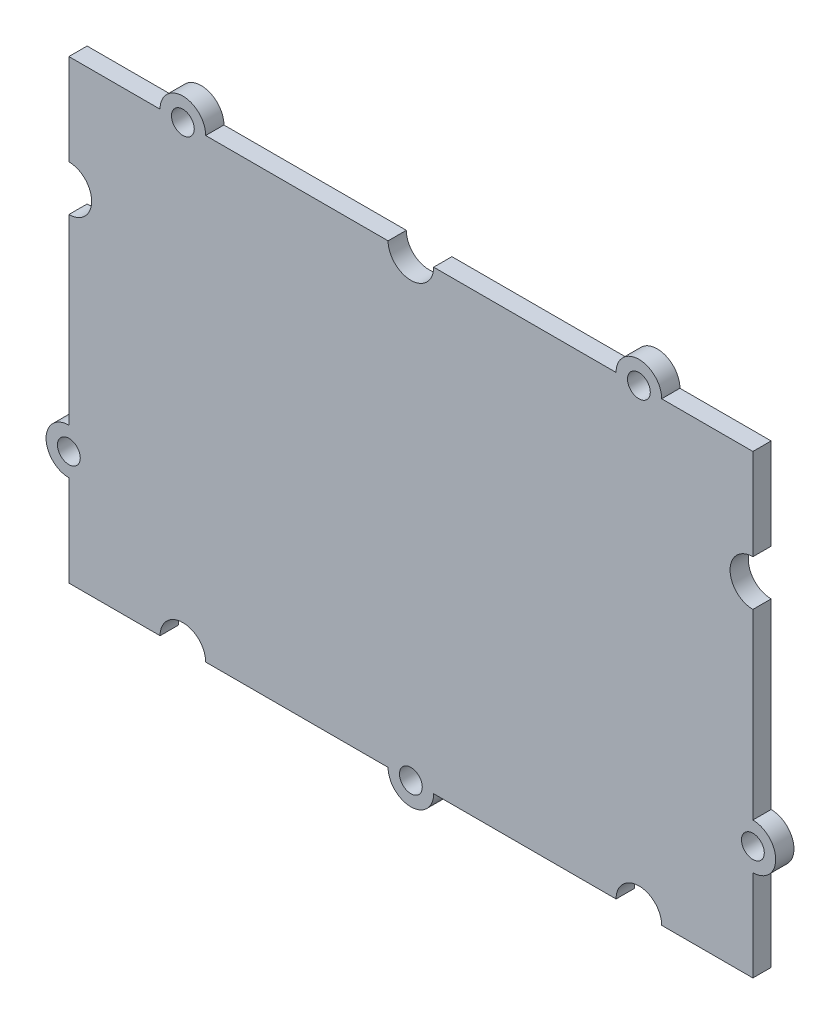
ISO-10303-21;
HEADER;
FILE_DESCRIPTION(('STEP AP214'),'2;1');
FILE_NAME('part.step','',(''),(''),'','','');
FILE_SCHEMA(('AUTOMOTIVE_DESIGN { 1 0 10303 214 1 1 1 1 }'));
ENDSEC;
DATA;
#1=APPLICATION_CONTEXT('core data for automotive mechanical design processes');
#2=APPLICATION_PROTOCOL_DEFINITION('international standard','automotive_design',2000,#1);
#3=PRODUCT_CONTEXT('',#1,'mechanical');
#4=PRODUCT('Part','Part','',(#3));
#5=PRODUCT_RELATED_PRODUCT_CATEGORY('part','',(#4));
#6=PRODUCT_DEFINITION_FORMATION('','',#4);
#7=PRODUCT_DEFINITION_CONTEXT('part definition',#1,'design');
#8=PRODUCT_DEFINITION('design','',#6,#7);
#9=PRODUCT_DEFINITION_SHAPE('','',#8);
#10=(LENGTH_UNIT() NAMED_UNIT(*) SI_UNIT(.MILLI.,.METRE.));
#11=(NAMED_UNIT(*) PLANE_ANGLE_UNIT() SI_UNIT($,.RADIAN.));
#12=(NAMED_UNIT(*) SI_UNIT($,.STERADIAN.) SOLID_ANGLE_UNIT());
#13=UNCERTAINTY_MEASURE_WITH_UNIT(LENGTH_MEASURE(1.E-05),#10,'distance_accuracy_value','');
#14=(GEOMETRIC_REPRESENTATION_CONTEXT(3) GLOBAL_UNCERTAINTY_ASSIGNED_CONTEXT((#13)) GLOBAL_UNIT_ASSIGNED_CONTEXT((#10,
#11,#12)) REPRESENTATION_CONTEXT('',''));
#15=CARTESIAN_POINT('',(0.,0.,0.));
#16=DIRECTION('',(0.,0.,1.));
#17=DIRECTION('',(1.,0.,0.));
#18=AXIS2_PLACEMENT_3D('',#15,#16,#17);
#19=CARTESIAN_POINT('',(-30.,10.,1.6));
#20=DIRECTION('',(0.,0.,-1.));
#21=DIRECTION('',(-1.,0.,0.));
#22=AXIS2_PLACEMENT_3D('',#19,#20,#21);
#23=PLANE('',#22);
#24=DIRECTION('',(0.,-1.,0.));
#25=VECTOR('',#24,1.);
#26=CARTESIAN_POINT('',(-30.,20.,1.6));
#27=LINE('',#26,#25);
#28=CARTESIAN_POINT('',(-30.,20.,1.6));
#29=VERTEX_POINT('',#28);
#30=CARTESIAN_POINT('',(-30.,12.,1.6));
#31=VERTEX_POINT('',#30);
#32=EDGE_CURVE('E274',#29,#31,#27,.T.);
#33=ORIENTED_EDGE('',*,*,#32,.T.);
#34=CARTESIAN_POINT('',(-30.,10.,1.6));
#35=DIRECTION('',(0.,0.,-1.));
#36=DIRECTION('',(-1.,0.,0.));
#37=AXIS2_PLACEMENT_3D('',#34,#35,#36);
#38=CIRCLE('',#37,2.);
#39=CARTESIAN_POINT('',(-30.,8.,1.6));
#40=VERTEX_POINT('',#39);
#41=EDGE_CURVE('E142',#31,#40,#38,.T.);
#42=ORIENTED_EDGE('',*,*,#41,.T.);
#43=DIRECTION('',(0.,-1.,0.));
#44=VECTOR('',#43,1.);
#45=CARTESIAN_POINT('',(-30.,8.,1.6));
#46=LINE('',#45,#44);
#47=CARTESIAN_POINT('',(-30.,-8.,1.6));
#48=VERTEX_POINT('',#47);
#49=EDGE_CURVE('E337',#40,#48,#46,.T.);
#50=ORIENTED_EDGE('',*,*,#49,.T.);
#51=CARTESIAN_POINT('',(-30.,-10.,1.6));
#52=DIRECTION('',(0.,0.,1.));
#53=DIRECTION('',(-1.,0.,0.));
#54=AXIS2_PLACEMENT_3D('',#51,#52,#53);
#55=CIRCLE('',#54,2.);
#56=CARTESIAN_POINT('',(-30.,-12.,1.6));
#57=VERTEX_POINT('',#56);
#58=EDGE_CURVE('E356',#48,#57,#55,.T.);
#59=ORIENTED_EDGE('',*,*,#58,.T.);
#60=DIRECTION('',(0.,-1.,0.));
#61=VECTOR('',#60,1.);
#62=CARTESIAN_POINT('',(-30.,-12.,1.6));
#63=LINE('',#62,#61);
#64=CARTESIAN_POINT('',(-30.,-20.,1.6));
#65=VERTEX_POINT('',#64);
#66=EDGE_CURVE('E353',#57,#65,#63,.T.);
#67=ORIENTED_EDGE('',*,*,#66,.T.);
#68=DIRECTION('',(1.,0.,0.));
#69=VECTOR('',#68,1.);
#70=CARTESIAN_POINT('',(-30.,-20.,1.6));
#71=LINE('',#70,#69);
#72=CARTESIAN_POINT('',(-22.,-20.,1.6));
#73=VERTEX_POINT('',#72);
#74=EDGE_CURVE('E355',#65,#73,#71,.T.);
#75=ORIENTED_EDGE('',*,*,#74,.T.);
#76=CARTESIAN_POINT('',(-20.,-20.,1.6));
#77=DIRECTION('',(0.,0.,-1.));
#78=DIRECTION('',(-1.,0.,0.));
#79=AXIS2_PLACEMENT_3D('',#76,#77,#78);
#80=CIRCLE('',#79,2.);
#81=CARTESIAN_POINT('',(-18.,-20.,1.6));
#82=VERTEX_POINT('',#81);
#83=EDGE_CURVE('E358',#73,#82,#80,.T.);
#84=ORIENTED_EDGE('',*,*,#83,.T.);
#85=DIRECTION('',(1.,0.,0.));
#86=VECTOR('',#85,1.);
#87=CARTESIAN_POINT('',(-18.,-20.,1.6));
#88=LINE('',#87,#86);
#89=CARTESIAN_POINT('',(-2.00000000000001,-20.,1.6));
#90=VERTEX_POINT('',#89);
#91=EDGE_CURVE('E364',#82,#90,#88,.T.);
#92=ORIENTED_EDGE('',*,*,#91,.T.);
#93=CARTESIAN_POINT('',(0.,-20.,1.6));
#94=DIRECTION('',(0.,0.,1.));
#95=DIRECTION('',(-1.,0.,0.));
#96=AXIS2_PLACEMENT_3D('',#93,#94,#95);
#97=CIRCLE('',#96,2.);
#98=CARTESIAN_POINT('',(1.99999999999999,-20.,1.6));
#99=VERTEX_POINT('',#98);
#100=EDGE_CURVE('E366',#90,#99,#97,.T.);
#101=ORIENTED_EDGE('',*,*,#100,.T.);
#102=DIRECTION('',(1.,0.,0.));
#103=VECTOR('',#102,1.);
#104=CARTESIAN_POINT('',(1.99999999999999,-20.,1.6));
#105=LINE('',#104,#103);
#106=CARTESIAN_POINT('',(18.,-20.,1.6));
#107=VERTEX_POINT('',#106);
#108=EDGE_CURVE('E368',#99,#107,#105,.T.);
#109=ORIENTED_EDGE('',*,*,#108,.T.);
#110=CARTESIAN_POINT('',(20.,-20.,1.6));
#111=DIRECTION('',(0.,0.,-1.));
#112=DIRECTION('',(-1.,0.,0.));
#113=AXIS2_PLACEMENT_3D('',#110,#111,#112);
#114=CIRCLE('',#113,2.);
#115=CARTESIAN_POINT('',(22.,-20.,1.6));
#116=VERTEX_POINT('',#115);
#117=EDGE_CURVE('E370',#107,#116,#114,.T.);
#118=ORIENTED_EDGE('',*,*,#117,.T.);
#119=DIRECTION('',(1.,0.,0.));
#120=VECTOR('',#119,1.);
#121=CARTESIAN_POINT('',(22.,-20.,1.6));
#122=LINE('',#121,#120);
#123=CARTESIAN_POINT('',(30.,-20.,1.6));
#124=VERTEX_POINT('',#123);
#125=EDGE_CURVE('E372',#116,#124,#122,.T.);
#126=ORIENTED_EDGE('',*,*,#125,.T.);
#127=DIRECTION('',(0.,1.,0.));
#128=VECTOR('',#127,1.);
#129=CARTESIAN_POINT('',(30.,-12.,1.6));
#130=LINE('',#129,#128);
#131=CARTESIAN_POINT('',(30.,-12.,1.6));
#132=VERTEX_POINT('',#131);
#133=EDGE_CURVE('E374',#124,#132,#130,.T.);
#134=ORIENTED_EDGE('',*,*,#133,.T.);
#135=CARTESIAN_POINT('',(30.,-10.,1.6));
#136=DIRECTION('',(0.,0.,1.));
#137=DIRECTION('',(1.,0.,0.));
#138=AXIS2_PLACEMENT_3D('',#135,#136,#137);
#139=CIRCLE('',#138,2.);
#140=CARTESIAN_POINT('',(30.,-8.,1.6));
#141=VERTEX_POINT('',#140);
#142=EDGE_CURVE('E376',#132,#141,#139,.T.);
#143=ORIENTED_EDGE('',*,*,#142,.T.);
#144=DIRECTION('',(0.,1.,0.));
#145=VECTOR('',#144,1.);
#146=CARTESIAN_POINT('',(30.,8.,1.6));
#147=LINE('',#146,#145);
#148=CARTESIAN_POINT('',(30.,8.,1.6));
#149=VERTEX_POINT('',#148);
#150=EDGE_CURVE('E378',#141,#149,#147,.T.);
#151=ORIENTED_EDGE('',*,*,#150,.T.);
#152=CARTESIAN_POINT('',(30.,10.,1.6));
#153=DIRECTION('',(0.,0.,-1.));
#154=DIRECTION('',(1.,0.,0.));
#155=AXIS2_PLACEMENT_3D('',#152,#153,#154);
#156=CIRCLE('',#155,2.);
#157=CARTESIAN_POINT('',(30.,12.,1.6));
#158=VERTEX_POINT('',#157);
#159=EDGE_CURVE('E380',#149,#158,#156,.T.);
#160=ORIENTED_EDGE('',*,*,#159,.T.);
#161=DIRECTION('',(0.,1.,0.));
#162=VECTOR('',#161,1.);
#163=CARTESIAN_POINT('',(30.,20.,1.6));
#164=LINE('',#163,#162);
#165=CARTESIAN_POINT('',(30.,20.,1.6));
#166=VERTEX_POINT('',#165);
#167=EDGE_CURVE('E382',#158,#166,#164,.T.);
#168=ORIENTED_EDGE('',*,*,#167,.T.);
#169=DIRECTION('',(-1.,0.,0.));
#170=VECTOR('',#169,1.);
#171=CARTESIAN_POINT('',(22.,20.,1.6));
#172=LINE('',#171,#170);
#173=CARTESIAN_POINT('',(22.,20.,1.6));
#174=VERTEX_POINT('',#173);
#175=EDGE_CURVE('E384',#166,#174,#172,.T.);
#176=ORIENTED_EDGE('',*,*,#175,.T.);
#177=CARTESIAN_POINT('',(20.,20.,1.6));
#178=DIRECTION('',(0.,0.,1.));
#179=DIRECTION('',(1.,0.,0.));
#180=AXIS2_PLACEMENT_3D('',#177,#178,#179);
#181=CIRCLE('',#180,2.);
#182=CARTESIAN_POINT('',(18.,20.,1.6));
#183=VERTEX_POINT('',#182);
#184=EDGE_CURVE('E386',#174,#183,#181,.T.);
#185=ORIENTED_EDGE('',*,*,#184,.T.);
#186=DIRECTION('',(-1.,0.,0.));
#187=VECTOR('',#186,1.);
#188=CARTESIAN_POINT('',(1.99999999999999,20.,1.6));
#189=LINE('',#188,#187);
#190=CARTESIAN_POINT('',(1.99999999999999,20.,1.6));
#191=VERTEX_POINT('',#190);
#192=EDGE_CURVE('E388',#183,#191,#189,.T.);
#193=ORIENTED_EDGE('',*,*,#192,.T.);
#194=CARTESIAN_POINT('',(0.,20.,1.6));
#195=DIRECTION('',(0.,0.,-1.));
#196=DIRECTION('',(1.,0.,0.));
#197=AXIS2_PLACEMENT_3D('',#194,#195,#196);
#198=CIRCLE('',#197,2.);
#199=CARTESIAN_POINT('',(-2.00000000000001,20.,1.6));
#200=VERTEX_POINT('',#199);
#201=EDGE_CURVE('E209',#191,#200,#198,.T.);
#202=ORIENTED_EDGE('',*,*,#201,.T.);
#203=DIRECTION('',(-1.,0.,0.));
#204=VECTOR('',#203,1.);
#205=CARTESIAN_POINT('',(-18.,20.,1.6));
#206=LINE('',#205,#204);
#207=CARTESIAN_POINT('',(-18.,20.,1.6));
#208=VERTEX_POINT('',#207);
#209=EDGE_CURVE('E203',#200,#208,#206,.T.);
#210=ORIENTED_EDGE('',*,*,#209,.T.);
#211=CARTESIAN_POINT('',(-20.,20.,1.6));
#212=DIRECTION('',(0.,0.,1.));
#213=DIRECTION('',(1.,0.,0.));
#214=AXIS2_PLACEMENT_3D('',#211,#212,#213);
#215=CIRCLE('',#214,2.);
#216=CARTESIAN_POINT('',(-22.,20.,1.6));
#217=VERTEX_POINT('',#216);
#218=EDGE_CURVE('E207',#208,#217,#215,.T.);
#219=ORIENTED_EDGE('',*,*,#218,.T.);
#220=DIRECTION('',(-1.,0.,0.));
#221=VECTOR('',#220,1.);
#222=CARTESIAN_POINT('',(-30.,20.,1.6));
#223=LINE('',#222,#221);
#224=EDGE_CURVE('E51',#217,#29,#223,.T.);
#225=ORIENTED_EDGE('',*,*,#224,.T.);
#226=EDGE_LOOP('',(#33,#42,#50,#59,#67,#75,#84,#92,#101,#109,#118,#126,#134,#143,#151,#160,#168,
#176,#185,#193,#202,#210,#219,#225));
#227=FACE_BOUND('',#226,.T.);
#228=CARTESIAN_POINT('',(-20.,20.,1.6));
#229=DIRECTION('',(0.,0.,1.));
#230=DIRECTION('',(1.,0.,0.));
#231=AXIS2_PLACEMENT_3D('',#228,#229,#230);
#232=CIRCLE('',#231,1.);
#233=CARTESIAN_POINT('',(-19.,20.,1.6));
#234=VERTEX_POINT('',#233);
#235=EDGE_CURVE('E231',#234,#234,#232,.T.);
#236=ORIENTED_EDGE('',*,*,#235,.F.);
#237=EDGE_LOOP('',(#236));
#238=FACE_BOUND('',#237,.T.);
#239=CARTESIAN_POINT('',(20.,20.,1.6));
#240=DIRECTION('',(0.,0.,1.));
#241=DIRECTION('',(1.,0.,0.));
#242=AXIS2_PLACEMENT_3D('',#239,#240,#241);
#243=CIRCLE('',#242,1.);
#244=CARTESIAN_POINT('',(21.,20.,1.6));
#245=VERTEX_POINT('',#244);
#246=EDGE_CURVE('E462',#245,#245,#243,.T.);
#247=ORIENTED_EDGE('',*,*,#246,.F.);
#248=EDGE_LOOP('',(#247));
#249=FACE_BOUND('',#248,.T.);
#250=CARTESIAN_POINT('',(0.,-20.,1.6));
#251=DIRECTION('',(0.,0.,1.));
#252=DIRECTION('',(1.,0.,0.));
#253=AXIS2_PLACEMENT_3D('',#250,#251,#252);
#254=CIRCLE('',#253,1.);
#255=CARTESIAN_POINT('',(0.999999999999993,-20.,1.6));
#256=VERTEX_POINT('',#255);
#257=EDGE_CURVE('E456',#256,#256,#254,.T.);
#258=ORIENTED_EDGE('',*,*,#257,.F.);
#259=EDGE_LOOP('',(#258));
#260=FACE_BOUND('',#259,.T.);
#261=CARTESIAN_POINT('',(-30.,-10.,1.6));
#262=DIRECTION('',(0.,0.,1.));
#263=DIRECTION('',(1.,0.,0.));
#264=AXIS2_PLACEMENT_3D('',#261,#262,#263);
#265=CIRCLE('',#264,1.);
#266=CARTESIAN_POINT('',(-29.,-10.,1.6));
#267=VERTEX_POINT('',#266);
#268=EDGE_CURVE('E450',#267,#267,#265,.T.);
#269=ORIENTED_EDGE('',*,*,#268,.F.);
#270=EDGE_LOOP('',(#269));
#271=FACE_BOUND('',#270,.T.);
#272=CARTESIAN_POINT('',(30.,-10.,1.6));
#273=DIRECTION('',(0.,0.,1.));
#274=DIRECTION('',(1.,0.,0.));
#275=AXIS2_PLACEMENT_3D('',#272,#273,#274);
#276=CIRCLE('',#275,1.);
#277=CARTESIAN_POINT('',(31.,-10.,1.6));
#278=VERTEX_POINT('',#277);
#279=EDGE_CURVE('E441',#278,#278,#276,.T.);
#280=ORIENTED_EDGE('',*,*,#279,.F.);
#281=EDGE_LOOP('',(#280));
#282=FACE_BOUND('',#281,.T.);
#283=ADVANCED_FACE('F34',(#227,#238,#249,#260,#271,#282),#23,.F.);
#284=CARTESIAN_POINT('',(-30.,10.,0.));
#285=DIRECTION('',(0.,0.,-1.));
#286=DIRECTION('',(-1.,0.,0.));
#287=AXIS2_PLACEMENT_3D('',#284,#285,#286);
#288=PLANE('',#287);
#289=CARTESIAN_POINT('',(-30.,-10.,0.));
#290=DIRECTION('',(0.,0.,1.));
#291=DIRECTION('',(1.,0.,0.));
#292=AXIS2_PLACEMENT_3D('',#289,#290,#291);
#293=CIRCLE('',#292,1.);
#294=CARTESIAN_POINT('',(-29.,-10.,0.));
#295=VERTEX_POINT('',#294);
#296=EDGE_CURVE('E447',#295,#295,#293,.T.);
#297=ORIENTED_EDGE('',*,*,#296,.T.);
#298=EDGE_LOOP('',(#297));
#299=FACE_BOUND('',#298,.T.);
#300=CARTESIAN_POINT('',(20.,20.,0.));
#301=DIRECTION('',(0.,0.,1.));
#302=DIRECTION('',(1.,0.,0.));
#303=AXIS2_PLACEMENT_3D('',#300,#301,#302);
#304=CIRCLE('',#303,1.);
#305=CARTESIAN_POINT('',(21.,20.,0.));
#306=VERTEX_POINT('',#305);
#307=EDGE_CURVE('E459',#306,#306,#304,.T.);
#308=ORIENTED_EDGE('',*,*,#307,.T.);
#309=EDGE_LOOP('',(#308));
#310=FACE_BOUND('',#309,.T.);
#311=DIRECTION('',(0.,-1.,0.));
#312=VECTOR('',#311,1.);
#313=CARTESIAN_POINT('',(-30.,20.,0.));
#314=LINE('',#313,#312);
#315=CARTESIAN_POINT('',(-30.,20.,0.));
#316=VERTEX_POINT('',#315);
#317=CARTESIAN_POINT('',(-30.,12.,0.));
#318=VERTEX_POINT('',#317);
#319=EDGE_CURVE('E227',#316,#318,#314,.T.);
#320=ORIENTED_EDGE('',*,*,#319,.F.);
#321=DIRECTION('',(-1.,0.,0.));
#322=VECTOR('',#321,1.);
#323=CARTESIAN_POINT('',(-30.,20.,0.));
#324=LINE('',#323,#322);
#325=CARTESIAN_POINT('',(-22.,20.,0.));
#326=VERTEX_POINT('',#325);
#327=EDGE_CURVE('E134',#326,#316,#324,.T.);
#328=ORIENTED_EDGE('',*,*,#327,.F.);
#329=CARTESIAN_POINT('',(-20.,20.,0.));
#330=DIRECTION('',(0.,0.,1.));
#331=DIRECTION('',(1.,0.,0.));
#332=AXIS2_PLACEMENT_3D('',#329,#330,#331);
#333=CIRCLE('',#332,2.);
#334=CARTESIAN_POINT('',(-18.,20.,0.));
#335=VERTEX_POINT('',#334);
#336=EDGE_CURVE('E128',#335,#326,#333,.T.);
#337=ORIENTED_EDGE('',*,*,#336,.F.);
#338=DIRECTION('',(-1.,0.,0.));
#339=VECTOR('',#338,1.);
#340=CARTESIAN_POINT('',(-18.,20.,0.));
#341=LINE('',#340,#339);
#342=CARTESIAN_POINT('',(-2.00000000000001,20.,0.));
#343=VERTEX_POINT('',#342);
#344=EDGE_CURVE('E217',#343,#335,#341,.T.);
#345=ORIENTED_EDGE('',*,*,#344,.F.);
#346=CARTESIAN_POINT('',(0.,20.,0.));
#347=DIRECTION('',(0.,0.,-1.));
#348=DIRECTION('',(1.,0.,0.));
#349=AXIS2_PLACEMENT_3D('',#346,#347,#348);
#350=CIRCLE('',#349,2.);
#351=CARTESIAN_POINT('',(1.99999999999999,20.,0.));
#352=VERTEX_POINT('',#351);
#353=EDGE_CURVE('E269',#352,#343,#350,.T.);
#354=ORIENTED_EDGE('',*,*,#353,.F.);
#355=DIRECTION('',(-1.,0.,0.));
#356=VECTOR('',#355,1.);
#357=CARTESIAN_POINT('',(1.99999999999999,20.,0.));
#358=LINE('',#357,#356);
#359=CARTESIAN_POINT('',(18.,20.,0.));
#360=VERTEX_POINT('',#359);
#361=EDGE_CURVE('E267',#360,#352,#358,.T.);
#362=ORIENTED_EDGE('',*,*,#361,.F.);
#363=CARTESIAN_POINT('',(20.,20.,0.));
#364=DIRECTION('',(0.,0.,1.));
#365=DIRECTION('',(1.,0.,0.));
#366=AXIS2_PLACEMENT_3D('',#363,#364,#365);
#367=CIRCLE('',#366,2.);
#368=CARTESIAN_POINT('',(22.,20.,0.));
#369=VERTEX_POINT('',#368);
#370=EDGE_CURVE('E265',#369,#360,#367,.T.);
#371=ORIENTED_EDGE('',*,*,#370,.F.);
#372=DIRECTION('',(-1.,0.,0.));
#373=VECTOR('',#372,1.);
#374=CARTESIAN_POINT('',(22.,20.,0.));
#375=LINE('',#374,#373);
#376=CARTESIAN_POINT('',(30.,20.,0.));
#377=VERTEX_POINT('',#376);
#378=EDGE_CURVE('E263',#377,#369,#375,.T.);
#379=ORIENTED_EDGE('',*,*,#378,.F.);
#380=DIRECTION('',(0.,1.,0.));
#381=VECTOR('',#380,1.);
#382=CARTESIAN_POINT('',(30.,20.,0.));
#383=LINE('',#382,#381);
#384=CARTESIAN_POINT('',(30.,12.,0.));
#385=VERTEX_POINT('',#384);
#386=EDGE_CURVE('E261',#385,#377,#383,.T.);
#387=ORIENTED_EDGE('',*,*,#386,.F.);
#388=CARTESIAN_POINT('',(30.,10.,0.));
#389=DIRECTION('',(0.,0.,-1.));
#390=DIRECTION('',(1.,0.,0.));
#391=AXIS2_PLACEMENT_3D('',#388,#389,#390);
#392=CIRCLE('',#391,2.);
#393=CARTESIAN_POINT('',(30.,8.,0.));
#394=VERTEX_POINT('',#393);
#395=EDGE_CURVE('E259',#394,#385,#392,.T.);
#396=ORIENTED_EDGE('',*,*,#395,.F.);
#397=DIRECTION('',(0.,1.,0.));
#398=VECTOR('',#397,1.);
#399=CARTESIAN_POINT('',(30.,8.,0.));
#400=LINE('',#399,#398);
#401=CARTESIAN_POINT('',(30.,-8.,0.));
#402=VERTEX_POINT('',#401);
#403=EDGE_CURVE('E257',#402,#394,#400,.T.);
#404=ORIENTED_EDGE('',*,*,#403,.F.);
#405=CARTESIAN_POINT('',(30.,-10.,0.));
#406=DIRECTION('',(0.,0.,1.));
#407=DIRECTION('',(1.,0.,0.));
#408=AXIS2_PLACEMENT_3D('',#405,#406,#407);
#409=CIRCLE('',#408,2.);
#410=CARTESIAN_POINT('',(30.,-12.,0.));
#411=VERTEX_POINT('',#410);
#412=EDGE_CURVE('E255',#411,#402,#409,.T.);
#413=ORIENTED_EDGE('',*,*,#412,.F.);
#414=DIRECTION('',(0.,1.,0.));
#415=VECTOR('',#414,1.);
#416=CARTESIAN_POINT('',(30.,-12.,0.));
#417=LINE('',#416,#415);
#418=CARTESIAN_POINT('',(30.,-20.,0.));
#419=VERTEX_POINT('',#418);
#420=EDGE_CURVE('E253',#419,#411,#417,.T.);
#421=ORIENTED_EDGE('',*,*,#420,.F.);
#422=DIRECTION('',(1.,0.,0.));
#423=VECTOR('',#422,1.);
#424=CARTESIAN_POINT('',(22.,-20.,0.));
#425=LINE('',#424,#423);
#426=CARTESIAN_POINT('',(22.,-20.,0.));
#427=VERTEX_POINT('',#426);
#428=EDGE_CURVE('E251',#427,#419,#425,.T.);
#429=ORIENTED_EDGE('',*,*,#428,.F.);
#430=CARTESIAN_POINT('',(20.,-20.,0.));
#431=DIRECTION('',(0.,0.,-1.));
#432=DIRECTION('',(-1.,0.,0.));
#433=AXIS2_PLACEMENT_3D('',#430,#431,#432);
#434=CIRCLE('',#433,2.);
#435=CARTESIAN_POINT('',(18.,-20.,0.));
#436=VERTEX_POINT('',#435);
#437=EDGE_CURVE('E249',#436,#427,#434,.T.);
#438=ORIENTED_EDGE('',*,*,#437,.F.);
#439=DIRECTION('',(1.,0.,0.));
#440=VECTOR('',#439,1.);
#441=CARTESIAN_POINT('',(1.99999999999999,-20.,0.));
#442=LINE('',#441,#440);
#443=CARTESIAN_POINT('',(1.99999999999999,-20.,0.));
#444=VERTEX_POINT('',#443);
#445=EDGE_CURVE('E247',#444,#436,#442,.T.);
#446=ORIENTED_EDGE('',*,*,#445,.F.);
#447=CARTESIAN_POINT('',(0.,-20.,0.));
#448=DIRECTION('',(0.,0.,1.));
#449=DIRECTION('',(-1.,0.,0.));
#450=AXIS2_PLACEMENT_3D('',#447,#448,#449);
#451=CIRCLE('',#450,2.);
#452=CARTESIAN_POINT('',(-2.00000000000001,-20.,0.));
#453=VERTEX_POINT('',#452);
#454=EDGE_CURVE('E245',#453,#444,#451,.T.);
#455=ORIENTED_EDGE('',*,*,#454,.F.);
#456=DIRECTION('',(1.,0.,0.));
#457=VECTOR('',#456,1.);
#458=CARTESIAN_POINT('',(-18.,-20.,0.));
#459=LINE('',#458,#457);
#460=CARTESIAN_POINT('',(-18.,-20.,0.));
#461=VERTEX_POINT('',#460);
#462=EDGE_CURVE('E243',#461,#453,#459,.T.);
#463=ORIENTED_EDGE('',*,*,#462,.F.);
#464=CARTESIAN_POINT('',(-20.,-20.,0.));
#465=DIRECTION('',(0.,0.,-1.));
#466=DIRECTION('',(-1.,0.,0.));
#467=AXIS2_PLACEMENT_3D('',#464,#465,#466);
#468=CIRCLE('',#467,2.);
#469=CARTESIAN_POINT('',(-22.,-20.,0.));
#470=VERTEX_POINT('',#469);
#471=EDGE_CURVE('E241',#470,#461,#468,.T.);
#472=ORIENTED_EDGE('',*,*,#471,.F.);
#473=DIRECTION('',(1.,0.,0.));
#474=VECTOR('',#473,1.);
#475=CARTESIAN_POINT('',(-30.,-20.,0.));
#476=LINE('',#475,#474);
#477=CARTESIAN_POINT('',(-30.,-20.,0.));
#478=VERTEX_POINT('',#477);
#479=EDGE_CURVE('E239',#478,#470,#476,.T.);
#480=ORIENTED_EDGE('',*,*,#479,.F.);
#481=DIRECTION('',(0.,-1.,0.));
#482=VECTOR('',#481,1.);
#483=CARTESIAN_POINT('',(-30.,-12.,0.));
#484=LINE('',#483,#482);
#485=CARTESIAN_POINT('',(-30.,-12.,0.));
#486=VERTEX_POINT('',#485);
#487=EDGE_CURVE('E237',#486,#478,#484,.T.);
#488=ORIENTED_EDGE('',*,*,#487,.F.);
#489=CARTESIAN_POINT('',(-30.,-10.,0.));
#490=DIRECTION('',(0.,0.,1.));
#491=DIRECTION('',(-1.,0.,0.));
#492=AXIS2_PLACEMENT_3D('',#489,#490,#491);
#493=CIRCLE('',#492,2.);
#494=CARTESIAN_POINT('',(-30.,-8.,0.));
#495=VERTEX_POINT('',#494);
#496=EDGE_CURVE('E235',#495,#486,#493,.T.);
#497=ORIENTED_EDGE('',*,*,#496,.F.);
#498=DIRECTION('',(0.,-1.,0.));
#499=VECTOR('',#498,1.);
#500=CARTESIAN_POINT('',(-30.,8.,0.));
#501=LINE('',#500,#499);
#502=CARTESIAN_POINT('',(-30.,8.,0.));
#503=VERTEX_POINT('',#502);
#504=EDGE_CURVE('E233',#503,#495,#501,.T.);
#505=ORIENTED_EDGE('',*,*,#504,.F.);
#506=CARTESIAN_POINT('',(-30.,10.,0.));
#507=DIRECTION('',(0.,0.,-1.));
#508=DIRECTION('',(-1.,0.,0.));
#509=AXIS2_PLACEMENT_3D('',#506,#507,#508);
#510=CIRCLE('',#509,2.);
#511=EDGE_CURVE('E230',#318,#503,#510,.T.);
#512=ORIENTED_EDGE('',*,*,#511,.F.);
#513=EDGE_LOOP('',(#320,#328,#337,#345,#354,#362,#371,#379,#387,#396,#404,#413,#421,#429,#438,
#446,#455,#463,#472,#480,#488,#497,#505,#512));
#514=FACE_BOUND('',#513,.T.);
#515=CARTESIAN_POINT('',(-20.,20.,0.));
#516=DIRECTION('',(0.,0.,1.));
#517=DIRECTION('',(1.,0.,0.));
#518=AXIS2_PLACEMENT_3D('',#515,#516,#517);
#519=CIRCLE('',#518,1.);
#520=CARTESIAN_POINT('',(-19.,20.,0.));
#521=VERTEX_POINT('',#520);
#522=EDGE_CURVE('E465',#521,#521,#519,.T.);
#523=ORIENTED_EDGE('',*,*,#522,.T.);
#524=EDGE_LOOP('',(#523));
#525=FACE_BOUND('',#524,.T.);
#526=CARTESIAN_POINT('',(0.,-20.,0.));
#527=DIRECTION('',(0.,0.,1.));
#528=DIRECTION('',(1.,0.,0.));
#529=AXIS2_PLACEMENT_3D('',#526,#527,#528);
#530=CIRCLE('',#529,1.);
#531=CARTESIAN_POINT('',(0.999999999999993,-20.,0.));
#532=VERTEX_POINT('',#531);
#533=EDGE_CURVE('E453',#532,#532,#530,.T.);
#534=ORIENTED_EDGE('',*,*,#533,.T.);
#535=EDGE_LOOP('',(#534));
#536=FACE_BOUND('',#535,.T.);
#537=CARTESIAN_POINT('',(30.,-10.,0.));
#538=DIRECTION('',(0.,0.,1.));
#539=DIRECTION('',(1.,0.,0.));
#540=AXIS2_PLACEMENT_3D('',#537,#538,#539);
#541=CIRCLE('',#540,1.);
#542=CARTESIAN_POINT('',(31.,-10.,0.));
#543=VERTEX_POINT('',#542);
#544=EDGE_CURVE('E444',#543,#543,#541,.T.);
#545=ORIENTED_EDGE('',*,*,#544,.T.);
#546=EDGE_LOOP('',(#545));
#547=FACE_BOUND('',#546,.T.);
#548=ADVANCED_FACE('F341',(#299,#310,#514,#525,#536,#547),#288,.T.);
#549=CARTESIAN_POINT('',(-30.,20.,1.6));
#550=DIRECTION('',(1.,0.,0.));
#551=DIRECTION('',(0.,0.,-1.));
#552=AXIS2_PLACEMENT_3D('',#549,#550,#551);
#553=PLANE('',#552);
#554=ORIENTED_EDGE('',*,*,#319,.T.);
#555=DIRECTION('',(0.,0.,-1.));
#556=VECTOR('',#555,1.);
#557=CARTESIAN_POINT('',(-30.,12.,1.6));
#558=LINE('',#557,#556);
#559=EDGE_CURVE('E11',#31,#318,#558,.T.);
#560=ORIENTED_EDGE('',*,*,#559,.F.);
#561=ORIENTED_EDGE('',*,*,#32,.F.);
#562=DIRECTION('',(0.,0.,-1.));
#563=VECTOR('',#562,1.);
#564=CARTESIAN_POINT('',(-30.,20.,1.6));
#565=LINE('',#564,#563);
#566=EDGE_CURVE('E223',#29,#316,#565,.T.);
#567=ORIENTED_EDGE('',*,*,#566,.T.);
#568=EDGE_LOOP('',(#554,#560,#561,#567));
#569=FACE_BOUND('',#568,.T.);
#570=ADVANCED_FACE('F36',(#569),#553,.F.);
#571=CARTESIAN_POINT('',(-30.,10.,1.6));
#572=DIRECTION('',(0.,0.,-1.));
#573=DIRECTION('',(-1.,0.,0.));
#574=AXIS2_PLACEMENT_3D('',#571,#572,#573);
#575=CYLINDRICAL_SURFACE('',#574,2.);
#576=ORIENTED_EDGE('',*,*,#511,.T.);
#577=DIRECTION('',(0.,0.,-1.));
#578=VECTOR('',#577,1.);
#579=CARTESIAN_POINT('',(-30.,8.,1.6));
#580=LINE('',#579,#578);
#581=EDGE_CURVE('E43',#40,#503,#580,.T.);
#582=ORIENTED_EDGE('',*,*,#581,.F.);
#583=ORIENTED_EDGE('',*,*,#41,.F.);
#584=ORIENTED_EDGE('',*,*,#559,.T.);
#585=EDGE_LOOP('',(#576,#582,#583,#584));
#586=FACE_BOUND('',#585,.T.);
#587=ADVANCED_FACE('F706',(#586),#575,.F.);
#588=CARTESIAN_POINT('',(-30.,8.,1.6));
#589=DIRECTION('',(1.,0.,0.));
#590=DIRECTION('',(0.,0.,-1.));
#591=AXIS2_PLACEMENT_3D('',#588,#589,#590);
#592=PLANE('',#591);
#593=ORIENTED_EDGE('',*,*,#504,.T.);
#594=DIRECTION('',(0.,0.,-1.));
#595=VECTOR('',#594,1.);
#596=CARTESIAN_POINT('',(-30.,-8.,1.6));
#597=LINE('',#596,#595);
#598=EDGE_CURVE('E329',#48,#495,#597,.T.);
#599=ORIENTED_EDGE('',*,*,#598,.F.);
#600=ORIENTED_EDGE('',*,*,#49,.F.);
#601=ORIENTED_EDGE('',*,*,#581,.T.);
#602=EDGE_LOOP('',(#593,#599,#600,#601));
#603=FACE_BOUND('',#602,.T.);
#604=ADVANCED_FACE('F335',(#603),#592,.F.);
#605=CARTESIAN_POINT('',(-30.,-10.,1.6));
#606=DIRECTION('',(0.,0.,-1.));
#607=DIRECTION('',(-1.,0.,0.));
#608=AXIS2_PLACEMENT_3D('',#605,#606,#607);
#609=CYLINDRICAL_SURFACE('',#608,2.);
#610=ORIENTED_EDGE('',*,*,#496,.T.);
#611=DIRECTION('',(0.,0.,-1.));
#612=VECTOR('',#611,1.);
#613=CARTESIAN_POINT('',(-30.,-12.,1.6));
#614=LINE('',#613,#612);
#615=EDGE_CURVE('E326',#57,#486,#614,.T.);
#616=ORIENTED_EDGE('',*,*,#615,.F.);
#617=ORIENTED_EDGE('',*,*,#58,.F.);
#618=ORIENTED_EDGE('',*,*,#598,.T.);
#619=EDGE_LOOP('',(#610,#616,#617,#618));
#620=FACE_BOUND('',#619,.T.);
#621=ADVANCED_FACE('F347',(#620),#609,.T.);
#622=CARTESIAN_POINT('',(-30.,-12.,1.6));
#623=DIRECTION('',(1.,0.,0.));
#624=DIRECTION('',(0.,0.,-1.));
#625=AXIS2_PLACEMENT_3D('',#622,#623,#624);
#626=PLANE('',#625);
#627=ORIENTED_EDGE('',*,*,#487,.T.);
#628=DIRECTION('',(0.,0.,-1.));
#629=VECTOR('',#628,1.);
#630=CARTESIAN_POINT('',(-30.,-20.,1.6));
#631=LINE('',#630,#629);
#632=EDGE_CURVE('E323',#65,#478,#631,.T.);
#633=ORIENTED_EDGE('',*,*,#632,.F.);
#634=ORIENTED_EDGE('',*,*,#66,.F.);
#635=ORIENTED_EDGE('',*,*,#615,.T.);
#636=EDGE_LOOP('',(#627,#633,#634,#635));
#637=FACE_BOUND('',#636,.T.);
#638=ADVANCED_FACE('F351',(#637),#626,.F.);
#639=CARTESIAN_POINT('',(-30.,-20.,1.6));
#640=DIRECTION('',(0.,1.,0.));
#641=DIRECTION('',(0.,0.,1.));
#642=AXIS2_PLACEMENT_3D('',#639,#640,#641);
#643=PLANE('',#642);
#644=ORIENTED_EDGE('',*,*,#479,.T.);
#645=DIRECTION('',(0.,0.,-1.));
#646=VECTOR('',#645,1.);
#647=CARTESIAN_POINT('',(-22.,-20.,1.6));
#648=LINE('',#647,#646);
#649=EDGE_CURVE('E320',#73,#470,#648,.T.);
#650=ORIENTED_EDGE('',*,*,#649,.F.);
#651=ORIENTED_EDGE('',*,*,#74,.F.);
#652=ORIENTED_EDGE('',*,*,#632,.T.);
#653=EDGE_LOOP('',(#644,#650,#651,#652));
#654=FACE_BOUND('',#653,.T.);
#655=ADVANCED_FACE('F671',(#654),#643,.F.);
#656=CARTESIAN_POINT('',(-20.,-20.,1.6));
#657=DIRECTION('',(0.,0.,-1.));
#658=DIRECTION('',(-1.,0.,0.));
#659=AXIS2_PLACEMENT_3D('',#656,#657,#658);
#660=CYLINDRICAL_SURFACE('',#659,2.);
#661=ORIENTED_EDGE('',*,*,#471,.T.);
#662=DIRECTION('',(0.,0.,-1.));
#663=VECTOR('',#662,1.);
#664=CARTESIAN_POINT('',(-18.,-20.,1.6));
#665=LINE('',#664,#663);
#666=EDGE_CURVE('E317',#82,#461,#665,.T.);
#667=ORIENTED_EDGE('',*,*,#666,.F.);
#668=ORIENTED_EDGE('',*,*,#83,.F.);
#669=ORIENTED_EDGE('',*,*,#649,.T.);
#670=EDGE_LOOP('',(#661,#667,#668,#669));
#671=FACE_BOUND('',#670,.T.);
#672=ADVANCED_FACE('F661',(#671),#660,.F.);
#673=CARTESIAN_POINT('',(-18.,-20.,1.6));
#674=DIRECTION('',(0.,1.,0.));
#675=DIRECTION('',(0.,0.,1.));
#676=AXIS2_PLACEMENT_3D('',#673,#674,#675);
#677=PLANE('',#676);
#678=ORIENTED_EDGE('',*,*,#462,.T.);
#679=DIRECTION('',(0.,0.,-1.));
#680=VECTOR('',#679,1.);
#681=CARTESIAN_POINT('',(-2.00000000000001,-20.,1.6));
#682=LINE('',#681,#680);
#683=EDGE_CURVE('E314',#90,#453,#682,.T.);
#684=ORIENTED_EDGE('',*,*,#683,.F.);
#685=ORIENTED_EDGE('',*,*,#91,.F.);
#686=ORIENTED_EDGE('',*,*,#666,.T.);
#687=EDGE_LOOP('',(#678,#684,#685,#686));
#688=FACE_BOUND('',#687,.T.);
#689=ADVANCED_FACE('F651',(#688),#677,.F.);
#690=CARTESIAN_POINT('',(0.,-20.,1.6));
#691=DIRECTION('',(0.,0.,-1.));
#692=DIRECTION('',(-1.,0.,0.));
#693=AXIS2_PLACEMENT_3D('',#690,#691,#692);
#694=CYLINDRICAL_SURFACE('',#693,2.);
#695=ORIENTED_EDGE('',*,*,#454,.T.);
#696=DIRECTION('',(0.,0.,-1.));
#697=VECTOR('',#696,1.);
#698=CARTESIAN_POINT('',(1.99999999999999,-20.,1.6));
#699=LINE('',#698,#697);
#700=EDGE_CURVE('E311',#99,#444,#699,.T.);
#701=ORIENTED_EDGE('',*,*,#700,.F.);
#702=ORIENTED_EDGE('',*,*,#100,.F.);
#703=ORIENTED_EDGE('',*,*,#683,.T.);
#704=EDGE_LOOP('',(#695,#701,#702,#703));
#705=FACE_BOUND('',#704,.T.);
#706=ADVANCED_FACE('F641',(#705),#694,.T.);
#707=CARTESIAN_POINT('',(1.99999999999999,-20.,1.6));
#708=DIRECTION('',(0.,1.,0.));
#709=DIRECTION('',(0.,0.,1.));
#710=AXIS2_PLACEMENT_3D('',#707,#708,#709);
#711=PLANE('',#710);
#712=ORIENTED_EDGE('',*,*,#445,.T.);
#713=DIRECTION('',(0.,0.,-1.));
#714=VECTOR('',#713,1.);
#715=CARTESIAN_POINT('',(18.,-20.,1.6));
#716=LINE('',#715,#714);
#717=EDGE_CURVE('E308',#107,#436,#716,.T.);
#718=ORIENTED_EDGE('',*,*,#717,.F.);
#719=ORIENTED_EDGE('',*,*,#108,.F.);
#720=ORIENTED_EDGE('',*,*,#700,.T.);
#721=EDGE_LOOP('',(#712,#718,#719,#720));
#722=FACE_BOUND('',#721,.T.);
#723=ADVANCED_FACE('F631',(#722),#711,.F.);
#724=CARTESIAN_POINT('',(20.,-20.,1.6));
#725=DIRECTION('',(0.,0.,-1.));
#726=DIRECTION('',(-1.,0.,0.));
#727=AXIS2_PLACEMENT_3D('',#724,#725,#726);
#728=CYLINDRICAL_SURFACE('',#727,2.);
#729=ORIENTED_EDGE('',*,*,#437,.T.);
#730=DIRECTION('',(0.,0.,-1.));
#731=VECTOR('',#730,1.);
#732=CARTESIAN_POINT('',(22.,-20.,1.6));
#733=LINE('',#732,#731);
#734=EDGE_CURVE('E305',#116,#427,#733,.T.);
#735=ORIENTED_EDGE('',*,*,#734,.F.);
#736=ORIENTED_EDGE('',*,*,#117,.F.);
#737=ORIENTED_EDGE('',*,*,#717,.T.);
#738=EDGE_LOOP('',(#729,#735,#736,#737));
#739=FACE_BOUND('',#738,.T.);
#740=ADVANCED_FACE('F621',(#739),#728,.F.);
#741=CARTESIAN_POINT('',(22.,-20.,1.6));
#742=DIRECTION('',(0.,1.,0.));
#743=DIRECTION('',(0.,0.,1.));
#744=AXIS2_PLACEMENT_3D('',#741,#742,#743);
#745=PLANE('',#744);
#746=ORIENTED_EDGE('',*,*,#428,.T.);
#747=DIRECTION('',(0.,0.,-1.));
#748=VECTOR('',#747,1.);
#749=CARTESIAN_POINT('',(30.,-20.,1.6));
#750=LINE('',#749,#748);
#751=EDGE_CURVE('E302',#124,#419,#750,.T.);
#752=ORIENTED_EDGE('',*,*,#751,.F.);
#753=ORIENTED_EDGE('',*,*,#125,.F.);
#754=ORIENTED_EDGE('',*,*,#734,.T.);
#755=EDGE_LOOP('',(#746,#752,#753,#754));
#756=FACE_BOUND('',#755,.T.);
#757=ADVANCED_FACE('F611',(#756),#745,.F.);
#758=CARTESIAN_POINT('',(30.,-12.,1.6));
#759=DIRECTION('',(-1.,0.,0.));
#760=DIRECTION('',(0.,0.,1.));
#761=AXIS2_PLACEMENT_3D('',#758,#759,#760);
#762=PLANE('',#761);
#763=ORIENTED_EDGE('',*,*,#420,.T.);
#764=DIRECTION('',(0.,0.,-1.));
#765=VECTOR('',#764,1.);
#766=CARTESIAN_POINT('',(30.,-12.,1.6));
#767=LINE('',#766,#765);
#768=EDGE_CURVE('E299',#132,#411,#767,.T.);
#769=ORIENTED_EDGE('',*,*,#768,.F.);
#770=ORIENTED_EDGE('',*,*,#133,.F.);
#771=ORIENTED_EDGE('',*,*,#751,.T.);
#772=EDGE_LOOP('',(#763,#769,#770,#771));
#773=FACE_BOUND('',#772,.T.);
#774=ADVANCED_FACE('F601',(#773),#762,.F.);
#775=CARTESIAN_POINT('',(30.,-10.,1.6));
#776=DIRECTION('',(0.,0.,-1.));
#777=DIRECTION('',(-1.,0.,0.));
#778=AXIS2_PLACEMENT_3D('',#775,#776,#777);
#779=CYLINDRICAL_SURFACE('',#778,2.);
#780=ORIENTED_EDGE('',*,*,#412,.T.);
#781=DIRECTION('',(0.,0.,-1.));
#782=VECTOR('',#781,1.);
#783=CARTESIAN_POINT('',(30.,-8.,1.6));
#784=LINE('',#783,#782);
#785=EDGE_CURVE('E296',#141,#402,#784,.T.);
#786=ORIENTED_EDGE('',*,*,#785,.F.);
#787=ORIENTED_EDGE('',*,*,#142,.F.);
#788=ORIENTED_EDGE('',*,*,#768,.T.);
#789=EDGE_LOOP('',(#780,#786,#787,#788));
#790=FACE_BOUND('',#789,.T.);
#791=ADVANCED_FACE('F591',(#790),#779,.T.);
#792=CARTESIAN_POINT('',(30.,8.,1.6));
#793=DIRECTION('',(-1.,0.,0.));
#794=DIRECTION('',(0.,0.,1.));
#795=AXIS2_PLACEMENT_3D('',#792,#793,#794);
#796=PLANE('',#795);
#797=ORIENTED_EDGE('',*,*,#403,.T.);
#798=DIRECTION('',(0.,0.,-1.));
#799=VECTOR('',#798,1.);
#800=CARTESIAN_POINT('',(30.,8.,1.6));
#801=LINE('',#800,#799);
#802=EDGE_CURVE('E293',#149,#394,#801,.T.);
#803=ORIENTED_EDGE('',*,*,#802,.F.);
#804=ORIENTED_EDGE('',*,*,#150,.F.);
#805=ORIENTED_EDGE('',*,*,#785,.T.);
#806=EDGE_LOOP('',(#797,#803,#804,#805));
#807=FACE_BOUND('',#806,.T.);
#808=ADVANCED_FACE('F581',(#807),#796,.F.);
#809=CARTESIAN_POINT('',(30.,10.,1.6));
#810=DIRECTION('',(0.,0.,-1.));
#811=DIRECTION('',(-1.,0.,0.));
#812=AXIS2_PLACEMENT_3D('',#809,#810,#811);
#813=CYLINDRICAL_SURFACE('',#812,2.);
#814=ORIENTED_EDGE('',*,*,#395,.T.);
#815=DIRECTION('',(0.,0.,-1.));
#816=VECTOR('',#815,1.);
#817=CARTESIAN_POINT('',(30.,12.,1.6));
#818=LINE('',#817,#816);
#819=EDGE_CURVE('E290',#158,#385,#818,.T.);
#820=ORIENTED_EDGE('',*,*,#819,.F.);
#821=ORIENTED_EDGE('',*,*,#159,.F.);
#822=ORIENTED_EDGE('',*,*,#802,.T.);
#823=EDGE_LOOP('',(#814,#820,#821,#822));
#824=FACE_BOUND('',#823,.T.);
#825=ADVANCED_FACE('F571',(#824),#813,.F.);
#826=CARTESIAN_POINT('',(30.,20.,1.6));
#827=DIRECTION('',(-1.,0.,0.));
#828=DIRECTION('',(0.,0.,1.));
#829=AXIS2_PLACEMENT_3D('',#826,#827,#828);
#830=PLANE('',#829);
#831=ORIENTED_EDGE('',*,*,#386,.T.);
#832=DIRECTION('',(0.,0.,-1.));
#833=VECTOR('',#832,1.);
#834=CARTESIAN_POINT('',(30.,20.,1.6));
#835=LINE('',#834,#833);
#836=EDGE_CURVE('E287',#166,#377,#835,.T.);
#837=ORIENTED_EDGE('',*,*,#836,.F.);
#838=ORIENTED_EDGE('',*,*,#167,.F.);
#839=ORIENTED_EDGE('',*,*,#819,.T.);
#840=EDGE_LOOP('',(#831,#837,#838,#839));
#841=FACE_BOUND('',#840,.T.);
#842=ADVANCED_FACE('F561',(#841),#830,.F.);
#843=CARTESIAN_POINT('',(22.,20.,1.6));
#844=DIRECTION('',(0.,-1.,0.));
#845=DIRECTION('',(0.,0.,-1.));
#846=AXIS2_PLACEMENT_3D('',#843,#844,#845);
#847=PLANE('',#846);
#848=ORIENTED_EDGE('',*,*,#378,.T.);
#849=DIRECTION('',(0.,0.,-1.));
#850=VECTOR('',#849,1.);
#851=CARTESIAN_POINT('',(22.,20.,1.6));
#852=LINE('',#851,#850);
#853=EDGE_CURVE('E284',#174,#369,#852,.T.);
#854=ORIENTED_EDGE('',*,*,#853,.F.);
#855=ORIENTED_EDGE('',*,*,#175,.F.);
#856=ORIENTED_EDGE('',*,*,#836,.T.);
#857=EDGE_LOOP('',(#848,#854,#855,#856));
#858=FACE_BOUND('',#857,.T.);
#859=ADVANCED_FACE('F551',(#858),#847,.F.);
#860=CARTESIAN_POINT('',(20.,20.,1.6));
#861=DIRECTION('',(0.,0.,-1.));
#862=DIRECTION('',(-1.,0.,0.));
#863=AXIS2_PLACEMENT_3D('',#860,#861,#862);
#864=CYLINDRICAL_SURFACE('',#863,2.);
#865=ORIENTED_EDGE('',*,*,#370,.T.);
#866=DIRECTION('',(0.,0.,-1.));
#867=VECTOR('',#866,1.);
#868=CARTESIAN_POINT('',(18.,20.,1.6));
#869=LINE('',#868,#867);
#870=EDGE_CURVE('E281',#183,#360,#869,.T.);
#871=ORIENTED_EDGE('',*,*,#870,.F.);
#872=ORIENTED_EDGE('',*,*,#184,.F.);
#873=ORIENTED_EDGE('',*,*,#853,.T.);
#874=EDGE_LOOP('',(#865,#871,#872,#873));
#875=FACE_BOUND('',#874,.T.);
#876=ADVANCED_FACE('F542',(#875),#864,.T.);
#877=CARTESIAN_POINT('',(1.99999999999999,20.,1.6));
#878=DIRECTION('',(0.,-1.,0.));
#879=DIRECTION('',(0.,0.,-1.));
#880=AXIS2_PLACEMENT_3D('',#877,#878,#879);
#881=PLANE('',#880);
#882=ORIENTED_EDGE('',*,*,#361,.T.);
#883=DIRECTION('',(0.,0.,-1.));
#884=VECTOR('',#883,1.);
#885=CARTESIAN_POINT('',(1.99999999999999,20.,1.6));
#886=LINE('',#885,#884);
#887=EDGE_CURVE('E278',#191,#352,#886,.T.);
#888=ORIENTED_EDGE('',*,*,#887,.F.);
#889=ORIENTED_EDGE('',*,*,#192,.F.);
#890=ORIENTED_EDGE('',*,*,#870,.T.);
#891=EDGE_LOOP('',(#882,#888,#889,#890));
#892=FACE_BOUND('',#891,.T.);
#893=ADVANCED_FACE('F394',(#892),#881,.F.);
#894=CARTESIAN_POINT('',(0.,20.,1.6));
#895=DIRECTION('',(0.,0.,-1.));
#896=DIRECTION('',(-1.,0.,0.));
#897=AXIS2_PLACEMENT_3D('',#894,#895,#896);
#898=CYLINDRICAL_SURFACE('',#897,2.);
#899=ORIENTED_EDGE('',*,*,#353,.T.);
#900=DIRECTION('',(0.,0.,-1.));
#901=VECTOR('',#900,1.);
#902=CARTESIAN_POINT('',(-2.00000000000001,20.,1.6));
#903=LINE('',#902,#901);
#904=EDGE_CURVE('E218',#200,#343,#903,.T.);
#905=ORIENTED_EDGE('',*,*,#904,.F.);
#906=ORIENTED_EDGE('',*,*,#201,.F.);
#907=ORIENTED_EDGE('',*,*,#887,.T.);
#908=EDGE_LOOP('',(#899,#905,#906,#907));
#909=FACE_BOUND('',#908,.T.);
#910=ADVANCED_FACE('F398',(#909),#898,.F.);
#911=CARTESIAN_POINT('',(-18.,20.,1.6));
#912=DIRECTION('',(0.,-1.,0.));
#913=DIRECTION('',(0.,0.,-1.));
#914=AXIS2_PLACEMENT_3D('',#911,#912,#913);
#915=PLANE('',#914);
#916=ORIENTED_EDGE('',*,*,#344,.T.);
#917=DIRECTION('',(0.,0.,-1.));
#918=VECTOR('',#917,1.);
#919=CARTESIAN_POINT('',(-18.,20.,1.6));
#920=LINE('',#919,#918);
#921=EDGE_CURVE('E214',#208,#335,#920,.T.);
#922=ORIENTED_EDGE('',*,*,#921,.F.);
#923=ORIENTED_EDGE('',*,*,#209,.F.);
#924=ORIENTED_EDGE('',*,*,#904,.T.);
#925=EDGE_LOOP('',(#916,#922,#923,#924));
#926=FACE_BOUND('',#925,.T.);
#927=ADVANCED_FACE('F215',(#926),#915,.F.);
#928=CARTESIAN_POINT('',(-20.,20.,1.6));
#929=DIRECTION('',(0.,0.,-1.));
#930=DIRECTION('',(-1.,0.,0.));
#931=AXIS2_PLACEMENT_3D('',#928,#929,#930);
#932=CYLINDRICAL_SURFACE('',#931,2.);
#933=ORIENTED_EDGE('',*,*,#336,.T.);
#934=DIRECTION('',(0.,0.,-1.));
#935=VECTOR('',#934,1.);
#936=CARTESIAN_POINT('',(-22.,20.,1.6));
#937=LINE('',#936,#935);
#938=EDGE_CURVE('E219',#217,#326,#937,.T.);
#939=ORIENTED_EDGE('',*,*,#938,.F.);
#940=ORIENTED_EDGE('',*,*,#218,.F.);
#941=ORIENTED_EDGE('',*,*,#921,.T.);
#942=EDGE_LOOP('',(#933,#939,#940,#941));
#943=FACE_BOUND('',#942,.T.);
#944=ADVANCED_FACE('F221',(#943),#932,.T.);
#945=CARTESIAN_POINT('',(-30.,20.,1.6));
#946=DIRECTION('',(0.,-1.,0.));
#947=DIRECTION('',(0.,0.,-1.));
#948=AXIS2_PLACEMENT_3D('',#945,#946,#947);
#949=PLANE('',#948);
#950=ORIENTED_EDGE('',*,*,#327,.T.);
#951=ORIENTED_EDGE('',*,*,#566,.F.);
#952=ORIENTED_EDGE('',*,*,#224,.F.);
#953=ORIENTED_EDGE('',*,*,#938,.T.);
#954=EDGE_LOOP('',(#950,#951,#952,#953));
#955=FACE_BOUND('',#954,.T.);
#956=ADVANCED_FACE('F402',(#955),#949,.F.);
#957=CARTESIAN_POINT('',(-20.,20.,1.6));
#958=DIRECTION('',(0.,0.,-1.));
#959=DIRECTION('',(-1.,0.,0.));
#960=AXIS2_PLACEMENT_3D('',#957,#958,#959);
#961=CYLINDRICAL_SURFACE('',#960,1.);
#962=ORIENTED_EDGE('',*,*,#235,.T.);
#963=EDGE_LOOP('',(#962));
#964=FACE_BOUND('',#963,.T.);
#965=ORIENTED_EDGE('',*,*,#522,.F.);
#966=EDGE_LOOP('',(#965));
#967=FACE_BOUND('',#966,.T.);
#968=ADVANCED_FACE('F404',(#964,#967),#961,.F.);
#969=CARTESIAN_POINT('',(20.,20.,1.6));
#970=DIRECTION('',(0.,0.,-1.));
#971=DIRECTION('',(-1.,0.,0.));
#972=AXIS2_PLACEMENT_3D('',#969,#970,#971);
#973=CYLINDRICAL_SURFACE('',#972,1.);
#974=ORIENTED_EDGE('',*,*,#246,.T.);
#975=EDGE_LOOP('',(#974));
#976=FACE_BOUND('',#975,.T.);
#977=ORIENTED_EDGE('',*,*,#307,.F.);
#978=EDGE_LOOP('',(#977));
#979=FACE_BOUND('',#978,.T.);
#980=ADVANCED_FACE('F410',(#976,#979),#973,.F.);
#981=CARTESIAN_POINT('',(0.,-20.,1.6));
#982=DIRECTION('',(0.,0.,-1.));
#983=DIRECTION('',(-1.,0.,0.));
#984=AXIS2_PLACEMENT_3D('',#981,#982,#983);
#985=CYLINDRICAL_SURFACE('',#984,1.);
#986=ORIENTED_EDGE('',*,*,#257,.T.);
#987=EDGE_LOOP('',(#986));
#988=FACE_BOUND('',#987,.T.);
#989=ORIENTED_EDGE('',*,*,#533,.F.);
#990=EDGE_LOOP('',(#989));
#991=FACE_BOUND('',#990,.T.);
#992=ADVANCED_FACE('F424',(#988,#991),#985,.F.);
#993=CARTESIAN_POINT('',(-30.,-10.,1.6));
#994=DIRECTION('',(0.,0.,-1.));
#995=DIRECTION('',(-1.,0.,0.));
#996=AXIS2_PLACEMENT_3D('',#993,#994,#995);
#997=CYLINDRICAL_SURFACE('',#996,1.);
#998=ORIENTED_EDGE('',*,*,#268,.T.);
#999=EDGE_LOOP('',(#998));
#1000=FACE_BOUND('',#999,.T.);
#1001=ORIENTED_EDGE('',*,*,#296,.F.);
#1002=EDGE_LOOP('',(#1001));
#1003=FACE_BOUND('',#1002,.T.);
#1004=ADVANCED_FACE('F428',(#1000,#1003),#997,.F.);
#1005=CARTESIAN_POINT('',(30.,-10.,1.6));
#1006=DIRECTION('',(0.,0.,-1.));
#1007=DIRECTION('',(-1.,0.,0.));
#1008=AXIS2_PLACEMENT_3D('',#1005,#1006,#1007);
#1009=CYLINDRICAL_SURFACE('',#1008,1.);
#1010=ORIENTED_EDGE('',*,*,#279,.T.);
#1011=EDGE_LOOP('',(#1010));
#1012=FACE_BOUND('',#1011,.T.);
#1013=ORIENTED_EDGE('',*,*,#544,.F.);
#1014=EDGE_LOOP('',(#1013));
#1015=FACE_BOUND('',#1014,.T.);
#1016=ADVANCED_FACE('F432',(#1012,#1015),#1009,.F.);
#1017=CLOSED_SHELL('',(#283,#548,#570,#587,#604,#621,#638,#655,#672,#689,#706,#723,#740,#757,
#774,#791,#808,#825,#842,#859,#876,#893,#910,#927,#944,#956,#968,#980,#992,#1004,#1016));
#1018=MANIFOLD_SOLID_BREP('B2',#1017);
#1019=ADVANCED_BREP_SHAPE_REPRESENTATION('',(#18,#1018),#14);
#1020=SHAPE_DEFINITION_REPRESENTATION(#9,#1019);
ENDSEC;
END-ISO-10303-21;
